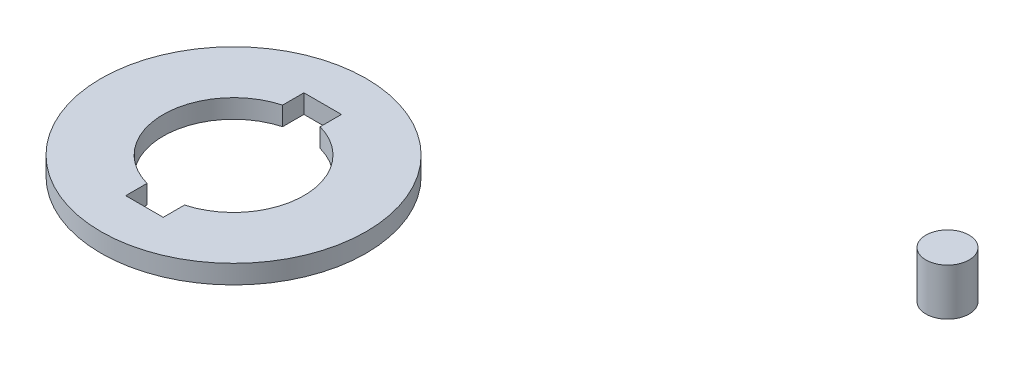
ISO-10303-21;
HEADER;
FILE_DESCRIPTION(('STEP AP214'),'2;1');
FILE_NAME('part.step','',(''),(''),'','','');
FILE_SCHEMA(('AUTOMOTIVE_DESIGN { 1 0 10303 214 1 1 1 1 }'));
ENDSEC;
DATA;
#1=APPLICATION_CONTEXT('core data for automotive mechanical design processes');
#2=APPLICATION_PROTOCOL_DEFINITION('international standard','automotive_design',2000,#1);
#3=PRODUCT_CONTEXT('',#1,'mechanical');
#4=PRODUCT('Part','Part','',(#3));
#5=PRODUCT_RELATED_PRODUCT_CATEGORY('part','',(#4));
#6=PRODUCT_DEFINITION_FORMATION('','',#4);
#7=PRODUCT_DEFINITION_CONTEXT('part definition',#1,'design');
#8=PRODUCT_DEFINITION('design','',#6,#7);
#9=PRODUCT_DEFINITION_SHAPE('','',#8);
#10=(LENGTH_UNIT() NAMED_UNIT(*) SI_UNIT(.MILLI.,.METRE.));
#11=(NAMED_UNIT(*) PLANE_ANGLE_UNIT() SI_UNIT($,.RADIAN.));
#12=(NAMED_UNIT(*) SI_UNIT($,.STERADIAN.) SOLID_ANGLE_UNIT());
#13=UNCERTAINTY_MEASURE_WITH_UNIT(LENGTH_MEASURE(1.E-05),#10,'distance_accuracy_value','');
#14=(GEOMETRIC_REPRESENTATION_CONTEXT(3) GLOBAL_UNCERTAINTY_ASSIGNED_CONTEXT((#13)) GLOBAL_UNIT_ASSIGNED_CONTEXT((#10,
#11,#12)) REPRESENTATION_CONTEXT('',''));
#15=CARTESIAN_POINT('',(0.,0.,0.));
#16=DIRECTION('',(0.,0.,1.));
#17=DIRECTION('',(1.,0.,0.));
#18=AXIS2_PLACEMENT_3D('',#15,#16,#17);
#19=CARTESIAN_POINT('',(77.6210541684893,10.8251594359311,-6.35000000000001));
#20=DIRECTION('',(0.,1.,0.));
#21=DIRECTION('',(-1.,0.,0.));
#22=AXIS2_PLACEMENT_3D('',#19,#20,#21);
#23=CYLINDRICAL_SURFACE('',#22,2.92100000000001);
#24=CARTESIAN_POINT('',(77.6210541684893,10.8251594359311,-6.35000000000001));
#25=DIRECTION('',(0.,-1.,0.));
#26=DIRECTION('',(1.,0.,0.));
#27=AXIS2_PLACEMENT_3D('',#24,#25,#26);
#28=CIRCLE('',#27,2.92100000000001);
#29=CARTESIAN_POINT('',(80.5420541684893,10.8251594359311,-6.35000000000001));
#30=VERTEX_POINT('',#29);
#31=EDGE_CURVE('E11',#30,#30,#28,.T.);
#32=ORIENTED_EDGE('',*,*,#31,.F.);
#33=EDGE_LOOP('',(#32));
#34=FACE_BOUND('',#33,.T.);
#35=CARTESIAN_POINT('',(77.6210541684893,17.1751594359311,-6.35000000000001));
#36=DIRECTION('',(0.,-1.,0.));
#37=DIRECTION('',(1.,0.,0.));
#38=AXIS2_PLACEMENT_3D('',#35,#36,#37);
#39=CIRCLE('',#38,2.92100000000001);
#40=CARTESIAN_POINT('',(80.5420541684893,17.1751594359311,-6.35000000000001));
#41=VERTEX_POINT('',#40);
#42=EDGE_CURVE('E52',#41,#41,#39,.T.);
#43=ORIENTED_EDGE('',*,*,#42,.T.);
#44=EDGE_LOOP('',(#43));
#45=FACE_BOUND('',#44,.T.);
#46=ADVANCED_FACE('F49',(#34,#45),#23,.T.);
#47=CARTESIAN_POINT('',(0.,10.8251594359311,0.));
#48=DIRECTION('',(0.,-1.,0.));
#49=DIRECTION('',(1.,0.,0.));
#50=AXIS2_PLACEMENT_3D('',#47,#48,#49);
#51=PLANE('',#50);
#52=ORIENTED_EDGE('',*,*,#31,.T.);
#53=EDGE_LOOP('',(#52));
#54=FACE_BOUND('',#53,.T.);
#55=ADVANCED_FACE('F64',(#54),#51,.T.);
#56=CARTESIAN_POINT('',(0.,17.1751594359311,0.));
#57=DIRECTION('',(0.,-1.,0.));
#58=DIRECTION('',(1.,0.,0.));
#59=AXIS2_PLACEMENT_3D('',#56,#57,#58);
#60=PLANE('',#59);
#61=ORIENTED_EDGE('',*,*,#42,.F.);
#62=EDGE_LOOP('',(#61));
#63=FACE_BOUND('',#62,.T.);
#64=ADVANCED_FACE('F62',(#63),#60,.F.);
#65=CLOSED_SHELL('',(#46,#55,#64));
#66=MANIFOLD_SOLID_BREP('B2',#65);
#67=CARTESIAN_POINT('',(0.,-3.81,12.7));
#68=DIRECTION('',(0.,1.,0.));
#69=DIRECTION('',(-1.,0.,0.));
#70=AXIS2_PLACEMENT_3D('',#67,#68,#69);
#71=CYLINDRICAL_SURFACE('',#70,9.525);
#72=DIRECTION('',(0.,1.,0.));
#73=VECTOR('',#72,1.);
#74=CARTESIAN_POINT('',(2.54,-3.81,3.51991149280139));
#75=LINE('',#74,#73);
#76=CARTESIAN_POINT('',(2.54,-3.81,3.51991149280139));
#77=VERTEX_POINT('',#76);
#78=CARTESIAN_POINT('',(2.54,-1.27,3.51991149280139));
#79=VERTEX_POINT('',#78);
#80=EDGE_CURVE('E231',#77,#79,#75,.T.);
#81=ORIENTED_EDGE('',*,*,#80,.F.);
#82=CARTESIAN_POINT('',(0.,-3.81,12.7));
#83=DIRECTION('',(0.,1.,0.));
#84=DIRECTION('',(0.,0.,1.));
#85=AXIS2_PLACEMENT_3D('',#82,#83,#84);
#86=CIRCLE('',#85,9.525);
#87=CARTESIAN_POINT('',(2.54,-3.81,21.8800885071986));
#88=VERTEX_POINT('',#87);
#89=EDGE_CURVE('E112',#88,#77,#86,.T.);
#90=ORIENTED_EDGE('',*,*,#89,.F.);
#91=DIRECTION('',(0.,1.,0.));
#92=VECTOR('',#91,1.);
#93=CARTESIAN_POINT('',(2.54,-3.81,21.8800885071986));
#94=LINE('',#93,#92);
#95=CARTESIAN_POINT('',(2.54,-1.27,21.8800885071986));
#96=VERTEX_POINT('',#95);
#97=EDGE_CURVE('E230',#88,#96,#94,.T.);
#98=ORIENTED_EDGE('',*,*,#97,.T.);
#99=CARTESIAN_POINT('',(0.,-1.27,12.7));
#100=DIRECTION('',(0.,1.,0.));
#101=DIRECTION('',(0.,0.,1.));
#102=AXIS2_PLACEMENT_3D('',#99,#100,#101);
#103=CIRCLE('',#102,9.525);
#104=EDGE_CURVE('E198',#96,#79,#103,.T.);
#105=ORIENTED_EDGE('',*,*,#104,.T.);
#106=EDGE_LOOP('',(#81,#90,#98,#105));
#107=FACE_BOUND('',#106,.T.);
#108=ADVANCED_FACE('F102',(#107),#71,.F.);
#109=CARTESIAN_POINT('',(0.,-3.81,12.7));
#110=DIRECTION('',(0.,1.,0.));
#111=DIRECTION('',(0.,0.,1.));
#112=AXIS2_PLACEMENT_3D('',#109,#110,#111);
#113=CIRCLE('',#112,9.525);
#114=CARTESIAN_POINT('',(-2.54,-3.81,3.51991149280139));
#115=VERTEX_POINT('',#114);
#116=CARTESIAN_POINT('',(-2.54,-3.81,21.8800885071986));
#117=VERTEX_POINT('',#116);
#118=EDGE_CURVE('E188',#115,#117,#113,.T.);
#119=ORIENTED_EDGE('',*,*,#118,.F.);
#120=DIRECTION('',(0.,1.,0.));
#121=VECTOR('',#120,1.);
#122=CARTESIAN_POINT('',(-2.54,-3.81,3.51991149280139));
#123=LINE('',#122,#121);
#124=CARTESIAN_POINT('',(-2.54,-1.27,3.51991149280139));
#125=VERTEX_POINT('',#124);
#126=EDGE_CURVE('E173',#115,#125,#123,.T.);
#127=ORIENTED_EDGE('',*,*,#126,.T.);
#128=CARTESIAN_POINT('',(0.,-1.27,12.7));
#129=DIRECTION('',(0.,1.,0.));
#130=DIRECTION('',(0.,0.,1.));
#131=AXIS2_PLACEMENT_3D('',#128,#129,#130);
#132=CIRCLE('',#131,9.525);
#133=CARTESIAN_POINT('',(-2.54,-1.27,21.8800885071986));
#134=VERTEX_POINT('',#133);
#135=EDGE_CURVE('E211',#125,#134,#132,.T.);
#136=ORIENTED_EDGE('',*,*,#135,.T.);
#137=DIRECTION('',(0.,1.,0.));
#138=VECTOR('',#137,1.);
#139=CARTESIAN_POINT('',(-2.54,-3.81,21.8800885071986));
#140=LINE('',#139,#138);
#141=EDGE_CURVE('E121',#117,#134,#140,.T.);
#142=ORIENTED_EDGE('',*,*,#141,.F.);
#143=EDGE_LOOP('',(#119,#127,#136,#142));
#144=FACE_BOUND('',#143,.T.);
#145=ADVANCED_FACE('F192',(#144),#71,.F.);
#146=CARTESIAN_POINT('',(0.,-3.81,12.7));
#147=DIRECTION('',(0.,1.,0.));
#148=DIRECTION('',(-1.,0.,0.));
#149=AXIS2_PLACEMENT_3D('',#146,#147,#148);
#150=CYLINDRICAL_SURFACE('',#149,17.9578);
#151=CARTESIAN_POINT('',(0.,-3.81,12.7));
#152=DIRECTION('',(0.,1.,0.));
#153=DIRECTION('',(-1.,0.,0.));
#154=AXIS2_PLACEMENT_3D('',#151,#152,#153);
#155=CIRCLE('',#154,17.9578);
#156=CARTESIAN_POINT('',(-17.9578,-3.81,12.7));
#157=VERTEX_POINT('',#156);
#158=EDGE_CURVE('E47',#157,#157,#155,.T.);
#159=ORIENTED_EDGE('',*,*,#158,.T.);
#160=EDGE_LOOP('',(#159));
#161=FACE_BOUND('',#160,.T.);
#162=CARTESIAN_POINT('',(0.,-1.27,12.7));
#163=DIRECTION('',(0.,1.,0.));
#164=DIRECTION('',(0.,0.,1.));
#165=AXIS2_PLACEMENT_3D('',#162,#163,#164);
#166=CIRCLE('',#165,17.9578);
#167=CARTESIAN_POINT('',(0.,-1.27,30.6578));
#168=VERTEX_POINT('',#167);
#169=EDGE_CURVE('E193',#168,#168,#166,.T.);
#170=ORIENTED_EDGE('',*,*,#169,.F.);
#171=EDGE_LOOP('',(#170));
#172=FACE_BOUND('',#171,.T.);
#173=ADVANCED_FACE('F269',(#161,#172),#150,.T.);
#174=CARTESIAN_POINT('',(0.,-3.81,0.));
#175=DIRECTION('',(0.,1.,0.));
#176=DIRECTION('',(0.,0.,1.));
#177=AXIS2_PLACEMENT_3D('',#174,#175,#176);
#178=PLANE('',#177);
#179=DIRECTION('',(1.,0.,0.));
#180=VECTOR('',#179,1.);
#181=CARTESIAN_POINT('',(0.,-3.81,0.634999999999997));
#182=LINE('',#181,#180);
#183=CARTESIAN_POINT('',(-2.54,-3.81,0.634999999999997));
#184=VERTEX_POINT('',#183);
#185=CARTESIAN_POINT('',(2.54,-3.81,0.634999999999997));
#186=VERTEX_POINT('',#185);
#187=EDGE_CURVE('E163',#184,#186,#182,.T.);
#188=ORIENTED_EDGE('',*,*,#187,.F.);
#189=DIRECTION('',(0.,0.,1.));
#190=VECTOR('',#189,1.);
#191=CARTESIAN_POINT('',(-2.54,-3.81,0.));
#192=LINE('',#191,#190);
#193=EDGE_CURVE('E176',#184,#115,#192,.T.);
#194=ORIENTED_EDGE('',*,*,#193,.T.);
#195=ORIENTED_EDGE('',*,*,#118,.T.);
#196=DIRECTION('',(0.,0.,-1.));
#197=VECTOR('',#196,1.);
#198=CARTESIAN_POINT('',(-2.54,-3.81,0.));
#199=LINE('',#198,#197);
#200=CARTESIAN_POINT('',(-2.54,-3.81,24.765));
#201=VERTEX_POINT('',#200);
#202=EDGE_CURVE('E169',#201,#117,#199,.T.);
#203=ORIENTED_EDGE('',*,*,#202,.F.);
#204=DIRECTION('',(1.,0.,0.));
#205=VECTOR('',#204,1.);
#206=CARTESIAN_POINT('',(0.,-3.81,24.765));
#207=LINE('',#206,#205);
#208=CARTESIAN_POINT('',(2.54,-3.81,24.765));
#209=VERTEX_POINT('',#208);
#210=EDGE_CURVE('E203',#201,#209,#207,.T.);
#211=ORIENTED_EDGE('',*,*,#210,.T.);
#212=DIRECTION('',(0.,0.,-1.));
#213=VECTOR('',#212,1.);
#214=CARTESIAN_POINT('',(2.54,-3.81,0.));
#215=LINE('',#214,#213);
#216=EDGE_CURVE('E206',#209,#88,#215,.T.);
#217=ORIENTED_EDGE('',*,*,#216,.T.);
#218=ORIENTED_EDGE('',*,*,#89,.T.);
#219=DIRECTION('',(0.,0.,1.));
#220=VECTOR('',#219,1.);
#221=CARTESIAN_POINT('',(2.54,-3.81,0.));
#222=LINE('',#221,#220);
#223=EDGE_CURVE('E209',#186,#77,#222,.T.);
#224=ORIENTED_EDGE('',*,*,#223,.F.);
#225=EDGE_LOOP('',(#188,#194,#195,#203,#211,#217,#218,#224));
#226=FACE_BOUND('',#225,.T.);
#227=ORIENTED_EDGE('',*,*,#158,.F.);
#228=EDGE_LOOP('',(#227));
#229=FACE_BOUND('',#228,.T.);
#230=ADVANCED_FACE('F186',(#226,#229),#178,.F.);
#231=CARTESIAN_POINT('',(0.,-1.27,0.));
#232=DIRECTION('',(0.,1.,0.));
#233=DIRECTION('',(0.,0.,1.));
#234=AXIS2_PLACEMENT_3D('',#231,#232,#233);
#235=PLANE('',#234);
#236=DIRECTION('',(0.,0.,1.));
#237=VECTOR('',#236,1.);
#238=CARTESIAN_POINT('',(-2.54,-1.27,0.));
#239=LINE('',#238,#237);
#240=CARTESIAN_POINT('',(-2.54,-1.27,0.634999999999997));
#241=VERTEX_POINT('',#240);
#242=EDGE_CURVE('E178',#241,#125,#239,.T.);
#243=ORIENTED_EDGE('',*,*,#242,.F.);
#244=DIRECTION('',(1.,0.,0.));
#245=VECTOR('',#244,1.);
#246=CARTESIAN_POINT('',(0.,-1.27,0.634999999999997));
#247=LINE('',#246,#245);
#248=CARTESIAN_POINT('',(2.54,-1.27,0.634999999999997));
#249=VERTEX_POINT('',#248);
#250=EDGE_CURVE('E190',#241,#249,#247,.T.);
#251=ORIENTED_EDGE('',*,*,#250,.T.);
#252=DIRECTION('',(0.,0.,1.));
#253=VECTOR('',#252,1.);
#254=CARTESIAN_POINT('',(2.54,-1.27,0.));
#255=LINE('',#254,#253);
#256=EDGE_CURVE('E219',#249,#79,#255,.T.);
#257=ORIENTED_EDGE('',*,*,#256,.T.);
#258=ORIENTED_EDGE('',*,*,#104,.F.);
#259=DIRECTION('',(0.,0.,-1.));
#260=VECTOR('',#259,1.);
#261=CARTESIAN_POINT('',(2.54,-1.27,0.));
#262=LINE('',#261,#260);
#263=CARTESIAN_POINT('',(2.54,-1.27,24.765));
#264=VERTEX_POINT('',#263);
#265=EDGE_CURVE('E222',#264,#96,#262,.T.);
#266=ORIENTED_EDGE('',*,*,#265,.F.);
#267=DIRECTION('',(1.,0.,0.));
#268=VECTOR('',#267,1.);
#269=CARTESIAN_POINT('',(0.,-1.27,24.765));
#270=LINE('',#269,#268);
#271=CARTESIAN_POINT('',(-2.54,-1.27,24.765));
#272=VERTEX_POINT('',#271);
#273=EDGE_CURVE('E224',#272,#264,#270,.T.);
#274=ORIENTED_EDGE('',*,*,#273,.F.);
#275=DIRECTION('',(0.,0.,-1.));
#276=VECTOR('',#275,1.);
#277=CARTESIAN_POINT('',(-2.54,-1.27,0.));
#278=LINE('',#277,#276);
#279=EDGE_CURVE('E216',#272,#134,#278,.T.);
#280=ORIENTED_EDGE('',*,*,#279,.T.);
#281=ORIENTED_EDGE('',*,*,#135,.F.);
#282=EDGE_LOOP('',(#243,#251,#257,#258,#266,#274,#280,#281));
#283=FACE_BOUND('',#282,.T.);
#284=ORIENTED_EDGE('',*,*,#169,.T.);
#285=EDGE_LOOP('',(#284));
#286=FACE_BOUND('',#285,.T.);
#287=ADVANCED_FACE('F246',(#283,#286),#235,.T.);
#288=CARTESIAN_POINT('',(-2.54,-3.81,0.));
#289=DIRECTION('',(1.,0.,0.));
#290=DIRECTION('',(0.,0.,-1.));
#291=AXIS2_PLACEMENT_3D('',#288,#289,#290);
#292=PLANE('',#291);
#293=ORIENTED_EDGE('',*,*,#279,.F.);
#294=DIRECTION('',(0.,1.,0.));
#295=VECTOR('',#294,1.);
#296=CARTESIAN_POINT('',(-2.54,-3.81,24.765));
#297=LINE('',#296,#295);
#298=EDGE_CURVE('E214',#201,#272,#297,.T.);
#299=ORIENTED_EDGE('',*,*,#298,.F.);
#300=ORIENTED_EDGE('',*,*,#202,.T.);
#301=ORIENTED_EDGE('',*,*,#141,.T.);
#302=EDGE_LOOP('',(#293,#299,#300,#301));
#303=FACE_BOUND('',#302,.T.);
#304=ADVANCED_FACE('F255',(#303),#292,.T.);
#305=CARTESIAN_POINT('',(0.,-3.81,24.765));
#306=DIRECTION('',(0.,0.,1.));
#307=DIRECTION('',(1.,0.,0.));
#308=AXIS2_PLACEMENT_3D('',#305,#306,#307);
#309=PLANE('',#308);
#310=ORIENTED_EDGE('',*,*,#273,.T.);
#311=DIRECTION('',(0.,1.,0.));
#312=VECTOR('',#311,1.);
#313=CARTESIAN_POINT('',(2.54,-3.81,24.765));
#314=LINE('',#313,#312);
#315=EDGE_CURVE('E229',#209,#264,#314,.T.);
#316=ORIENTED_EDGE('',*,*,#315,.F.);
#317=ORIENTED_EDGE('',*,*,#210,.F.);
#318=ORIENTED_EDGE('',*,*,#298,.T.);
#319=EDGE_LOOP('',(#310,#316,#317,#318));
#320=FACE_BOUND('',#319,.T.);
#321=ADVANCED_FACE('F254',(#320),#309,.F.);
#322=CARTESIAN_POINT('',(2.54,-3.81,0.));
#323=DIRECTION('',(1.,0.,0.));
#324=DIRECTION('',(0.,0.,-1.));
#325=AXIS2_PLACEMENT_3D('',#322,#323,#324);
#326=PLANE('',#325);
#327=ORIENTED_EDGE('',*,*,#265,.T.);
#328=ORIENTED_EDGE('',*,*,#97,.F.);
#329=ORIENTED_EDGE('',*,*,#216,.F.);
#330=ORIENTED_EDGE('',*,*,#315,.T.);
#331=EDGE_LOOP('',(#327,#328,#329,#330));
#332=FACE_BOUND('',#331,.T.);
#333=ADVANCED_FACE('F251',(#332),#326,.F.);
#334=CARTESIAN_POINT('',(-2.54,-3.81,0.));
#335=DIRECTION('',(-1.,0.,0.));
#336=DIRECTION('',(0.,0.,1.));
#337=AXIS2_PLACEMENT_3D('',#334,#335,#336);
#338=PLANE('',#337);
#339=ORIENTED_EDGE('',*,*,#242,.T.);
#340=ORIENTED_EDGE('',*,*,#126,.F.);
#341=ORIENTED_EDGE('',*,*,#193,.F.);
#342=DIRECTION('',(0.,1.,0.));
#343=VECTOR('',#342,1.);
#344=CARTESIAN_POINT('',(-2.54,-3.81,0.634999999999997));
#345=LINE('',#344,#343);
#346=EDGE_CURVE('E157',#184,#241,#345,.T.);
#347=ORIENTED_EDGE('',*,*,#346,.T.);
#348=EDGE_LOOP('',(#339,#340,#341,#347));
#349=FACE_BOUND('',#348,.T.);
#350=ADVANCED_FACE('F175',(#349),#338,.F.);
#351=CARTESIAN_POINT('',(0.,-3.81,0.634999999999997));
#352=DIRECTION('',(0.,0.,1.));
#353=DIRECTION('',(1.,0.,0.));
#354=AXIS2_PLACEMENT_3D('',#351,#352,#353);
#355=PLANE('',#354);
#356=ORIENTED_EDGE('',*,*,#250,.F.);
#357=ORIENTED_EDGE('',*,*,#346,.F.);
#358=ORIENTED_EDGE('',*,*,#187,.T.);
#359=DIRECTION('',(0.,1.,0.));
#360=VECTOR('',#359,1.);
#361=CARTESIAN_POINT('',(2.54,-3.81,0.634999999999997));
#362=LINE('',#361,#360);
#363=EDGE_CURVE('E106',#186,#249,#362,.T.);
#364=ORIENTED_EDGE('',*,*,#363,.T.);
#365=EDGE_LOOP('',(#356,#357,#358,#364));
#366=FACE_BOUND('',#365,.T.);
#367=ADVANCED_FACE('F317',(#366),#355,.T.);
#368=CARTESIAN_POINT('',(2.54,-3.81,0.));
#369=DIRECTION('',(-1.,0.,0.));
#370=DIRECTION('',(0.,0.,1.));
#371=AXIS2_PLACEMENT_3D('',#368,#369,#370);
#372=PLANE('',#371);
#373=ORIENTED_EDGE('',*,*,#256,.F.);
#374=ORIENTED_EDGE('',*,*,#363,.F.);
#375=ORIENTED_EDGE('',*,*,#223,.T.);
#376=ORIENTED_EDGE('',*,*,#80,.T.);
#377=EDGE_LOOP('',(#373,#374,#375,#376));
#378=FACE_BOUND('',#377,.T.);
#379=ADVANCED_FACE('F104',(#378),#372,.T.);
#380=CLOSED_SHELL('',(#108,#145,#173,#230,#287,#304,#321,#333,#350,#367,#379));
#381=MANIFOLD_SOLID_BREP('B6',#380);
#382=ADVANCED_BREP_SHAPE_REPRESENTATION('',(#18,#66,#381),#14);
#383=SHAPE_DEFINITION_REPRESENTATION(#9,#382);
ENDSEC;
END-ISO-10303-21;
